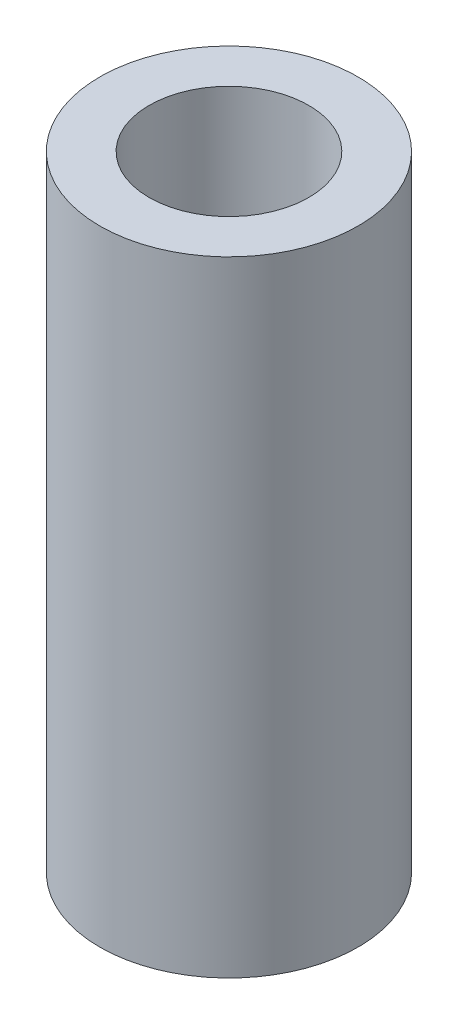
ISO-10303-21;
HEADER;
FILE_DESCRIPTION(('STEP AP214'),'2;1');
FILE_NAME('part.step','',(''),(''),'','','');
FILE_SCHEMA(('AUTOMOTIVE_DESIGN { 1 0 10303 214 1 1 1 1 }'));
ENDSEC;
DATA;
#1=APPLICATION_CONTEXT('core data for automotive mechanical design processes');
#2=APPLICATION_PROTOCOL_DEFINITION('international standard','automotive_design',2000,#1);
#3=PRODUCT_CONTEXT('',#1,'mechanical');
#4=PRODUCT('Part','Part','',(#3));
#5=PRODUCT_RELATED_PRODUCT_CATEGORY('part','',(#4));
#6=PRODUCT_DEFINITION_FORMATION('','',#4);
#7=PRODUCT_DEFINITION_CONTEXT('part definition',#1,'design');
#8=PRODUCT_DEFINITION('design','',#6,#7);
#9=PRODUCT_DEFINITION_SHAPE('','',#8);
#10=(LENGTH_UNIT() NAMED_UNIT(*) SI_UNIT(.MILLI.,.METRE.));
#11=(NAMED_UNIT(*) PLANE_ANGLE_UNIT() SI_UNIT($,.RADIAN.));
#12=(NAMED_UNIT(*) SI_UNIT($,.STERADIAN.) SOLID_ANGLE_UNIT());
#13=UNCERTAINTY_MEASURE_WITH_UNIT(LENGTH_MEASURE(1.E-05),#10,'distance_accuracy_value','');
#14=(GEOMETRIC_REPRESENTATION_CONTEXT(3) GLOBAL_UNCERTAINTY_ASSIGNED_CONTEXT((#13)) GLOBAL_UNIT_ASSIGNED_CONTEXT((#10,
#11,#12)) REPRESENTATION_CONTEXT('',''));
#15=CARTESIAN_POINT('',(0.,0.,0.));
#16=DIRECTION('',(0.,0.,1.));
#17=DIRECTION('',(1.,0.,0.));
#18=AXIS2_PLACEMENT_3D('',#15,#16,#17);
#19=CARTESIAN_POINT('',(0.,8.4455,0.));
#20=DIRECTION('',(0.,1.,0.));
#21=DIRECTION('',(0.,0.,1.));
#22=AXIS2_PLACEMENT_3D('',#19,#20,#21);
#23=PLANE('',#22);
#24=CARTESIAN_POINT('',(0.,8.4455,0.));
#25=DIRECTION('',(0.,1.,0.));
#26=DIRECTION('',(0.,0.,1.));
#27=AXIS2_PLACEMENT_3D('',#24,#25,#26);
#28=CIRCLE('',#27,3.4925);
#29=CARTESIAN_POINT('',(0.,8.4455,3.4925));
#30=VERTEX_POINT('',#29);
#31=EDGE_CURVE('E10',#30,#30,#28,.T.);
#32=ORIENTED_EDGE('',*,*,#31,.T.);
#33=EDGE_LOOP('',(#32));
#34=FACE_BOUND('',#33,.T.);
#35=CARTESIAN_POINT('',(0.,8.4455,0.));
#36=DIRECTION('',(0.,1.,0.));
#37=DIRECTION('',(0.,0.,1.));
#38=AXIS2_PLACEMENT_3D('',#35,#36,#37);
#39=CIRCLE('',#38,2.159);
#40=CARTESIAN_POINT('',(0.,8.4455,2.159));
#41=VERTEX_POINT('',#40);
#42=EDGE_CURVE('E50',#41,#41,#39,.T.);
#43=ORIENTED_EDGE('',*,*,#42,.F.);
#44=EDGE_LOOP('',(#43));
#45=FACE_BOUND('',#44,.T.);
#46=ADVANCED_FACE('F37',(#34,#45),#23,.T.);
#47=CARTESIAN_POINT('',(0.,-8.4455,0.));
#48=DIRECTION('',(0.,1.,0.));
#49=DIRECTION('',(0.,0.,1.));
#50=AXIS2_PLACEMENT_3D('',#47,#48,#49);
#51=PLANE('',#50);
#52=CARTESIAN_POINT('',(0.,-8.4455,0.));
#53=DIRECTION('',(0.,1.,0.));
#54=DIRECTION('',(0.,0.,1.));
#55=AXIS2_PLACEMENT_3D('',#52,#53,#54);
#56=CIRCLE('',#55,3.4925);
#57=CARTESIAN_POINT('',(0.,-8.4455,3.4925));
#58=VERTEX_POINT('',#57);
#59=EDGE_CURVE('E41',#58,#58,#56,.T.);
#60=ORIENTED_EDGE('',*,*,#59,.F.);
#61=EDGE_LOOP('',(#60));
#62=FACE_BOUND('',#61,.T.);
#63=CARTESIAN_POINT('',(0.,-8.4455,0.));
#64=DIRECTION('',(0.,1.,0.));
#65=DIRECTION('',(0.,0.,1.));
#66=AXIS2_PLACEMENT_3D('',#63,#64,#65);
#67=CIRCLE('',#66,2.159);
#68=CARTESIAN_POINT('',(0.,-8.4455,2.159));
#69=VERTEX_POINT('',#68);
#70=EDGE_CURVE('E52',#69,#69,#67,.T.);
#71=ORIENTED_EDGE('',*,*,#70,.T.);
#72=EDGE_LOOP('',(#71));
#73=FACE_BOUND('',#72,.T.);
#74=ADVANCED_FACE('F64',(#62,#73),#51,.F.);
#75=CARTESIAN_POINT('',(0.,8.4455,0.));
#76=DIRECTION('',(0.,-1.,0.));
#77=DIRECTION('',(0.,0.,-1.));
#78=AXIS2_PLACEMENT_3D('',#75,#76,#77);
#79=CYLINDRICAL_SURFACE('',#78,3.4925);
#80=ORIENTED_EDGE('',*,*,#31,.F.);
#81=EDGE_LOOP('',(#80));
#82=FACE_BOUND('',#81,.T.);
#83=ORIENTED_EDGE('',*,*,#59,.T.);
#84=EDGE_LOOP('',(#83));
#85=FACE_BOUND('',#84,.T.);
#86=ADVANCED_FACE('F39',(#82,#85),#79,.T.);
#87=CARTESIAN_POINT('',(0.,8.4455,0.));
#88=DIRECTION('',(0.,-1.,0.));
#89=DIRECTION('',(0.,0.,-1.));
#90=AXIS2_PLACEMENT_3D('',#87,#88,#89);
#91=CYLINDRICAL_SURFACE('',#90,2.159);
#92=ORIENTED_EDGE('',*,*,#42,.T.);
#93=EDGE_LOOP('',(#92));
#94=FACE_BOUND('',#93,.T.);
#95=ORIENTED_EDGE('',*,*,#70,.F.);
#96=EDGE_LOOP('',(#95));
#97=FACE_BOUND('',#96,.T.);
#98=ADVANCED_FACE('F60',(#94,#97),#91,.F.);
#99=CLOSED_SHELL('',(#46,#74,#86,#98));
#100=MANIFOLD_SOLID_BREP('B2',#99);
#101=ADVANCED_BREP_SHAPE_REPRESENTATION('',(#18,#100),#14);
#102=SHAPE_DEFINITION_REPRESENTATION(#9,#101);
ENDSEC;
END-ISO-10303-21;
